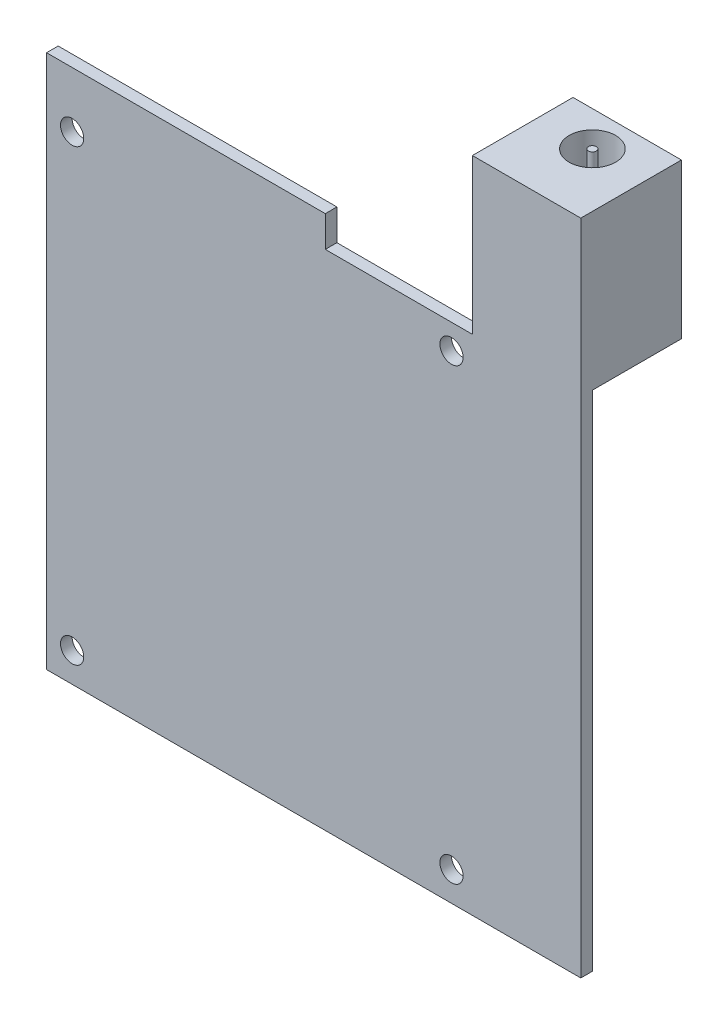
ISO-10303-21;
HEADER;
FILE_DESCRIPTION(('STEP AP214'),'2;1');
FILE_NAME('part.step','',(''),(''),'','','');
FILE_SCHEMA(('AUTOMOTIVE_DESIGN { 1 0 10303 214 1 1 1 1 }'));
ENDSEC;
DATA;
#1=APPLICATION_CONTEXT('core data for automotive mechanical design processes');
#2=APPLICATION_PROTOCOL_DEFINITION('international standard','automotive_design',2000,#1);
#3=PRODUCT_CONTEXT('',#1,'mechanical');
#4=PRODUCT('Part','Part','',(#3));
#5=PRODUCT_RELATED_PRODUCT_CATEGORY('part','',(#4));
#6=PRODUCT_DEFINITION_FORMATION('','',#4);
#7=PRODUCT_DEFINITION_CONTEXT('part definition',#1,'design');
#8=PRODUCT_DEFINITION('design','',#6,#7);
#9=PRODUCT_DEFINITION_SHAPE('','',#8);
#10=(LENGTH_UNIT() NAMED_UNIT(*) SI_UNIT(.MILLI.,.METRE.));
#11=(NAMED_UNIT(*) PLANE_ANGLE_UNIT() SI_UNIT($,.RADIAN.));
#12=(NAMED_UNIT(*) SI_UNIT($,.STERADIAN.) SOLID_ANGLE_UNIT());
#13=UNCERTAINTY_MEASURE_WITH_UNIT(LENGTH_MEASURE(1.E-05),#10,'distance_accuracy_value','');
#14=(GEOMETRIC_REPRESENTATION_CONTEXT(3) GLOBAL_UNCERTAINTY_ASSIGNED_CONTEXT((#13)) GLOBAL_UNIT_ASSIGNED_CONTEXT((#10,
#11,#12)) REPRESENTATION_CONTEXT('',''));
#15=CARTESIAN_POINT('',(0.,0.,0.));
#16=DIRECTION('',(0.,0.,1.));
#17=DIRECTION('',(1.,0.,0.));
#18=AXIS2_PLACEMENT_3D('',#15,#16,#17);
#19=CARTESIAN_POINT('',(0.,65.,1.5));
#20=DIRECTION('',(0.,1.,0.));
#21=DIRECTION('',(0.,0.,1.));
#22=AXIS2_PLACEMENT_3D('',#19,#20,#21);
#23=PLANE('',#22);
#24=DIRECTION('',(1.,0.,0.));
#25=VECTOR('',#24,1.);
#26=CARTESIAN_POINT('',(0.,65.,0.));
#27=LINE('',#26,#25);
#28=CARTESIAN_POINT('',(36.,65.,0.));
#29=VERTEX_POINT('',#28);
#30=CARTESIAN_POINT('',(55.,65.,0.));
#31=VERTEX_POINT('',#30);
#32=EDGE_CURVE('E153',#29,#31,#27,.T.);
#33=ORIENTED_EDGE('',*,*,#32,.F.);
#34=DIRECTION('',(0.,0.,-1.));
#35=VECTOR('',#34,1.);
#36=CARTESIAN_POINT('',(36.,65.,1.5));
#37=LINE('',#36,#35);
#38=CARTESIAN_POINT('',(36.,65.,1.5));
#39=VERTEX_POINT('',#38);
#40=EDGE_CURVE('E11',#39,#29,#37,.T.);
#41=ORIENTED_EDGE('',*,*,#40,.F.);
#42=DIRECTION('',(1.,0.,0.));
#43=VECTOR('',#42,1.);
#44=CARTESIAN_POINT('',(0.,65.,1.5));
#45=LINE('',#44,#43);
#46=CARTESIAN_POINT('',(55.,65.,1.5));
#47=VERTEX_POINT('',#46);
#48=EDGE_CURVE('E193',#39,#47,#45,.T.);
#49=ORIENTED_EDGE('',*,*,#48,.T.);
#50=DIRECTION('',(0.,0.,-1.));
#51=VECTOR('',#50,1.);
#52=CARTESIAN_POINT('',(55.,65.,1.5));
#53=LINE('',#52,#51);
#54=EDGE_CURVE('E146',#47,#31,#53,.T.);
#55=ORIENTED_EDGE('',*,*,#54,.T.);
#56=EDGE_LOOP('',(#33,#41,#49,#55));
#57=FACE_BOUND('',#56,.T.);
#58=ADVANCED_FACE('F36',(#57),#23,.T.);
#59=CARTESIAN_POINT('',(36.,0.,1.5));
#60=DIRECTION('',(1.,0.,0.));
#61=DIRECTION('',(0.,1.,0.));
#62=AXIS2_PLACEMENT_3D('',#59,#60,#61);
#63=PLANE('',#62);
#64=DIRECTION('',(0.,-1.,0.));
#65=VECTOR('',#64,1.);
#66=CARTESIAN_POINT('',(36.,0.,0.));
#67=LINE('',#66,#65);
#68=CARTESIAN_POINT('',(36.,69.,0.));
#69=VERTEX_POINT('',#68);
#70=EDGE_CURVE('E156',#69,#29,#67,.T.);
#71=ORIENTED_EDGE('',*,*,#70,.F.);
#72=DIRECTION('',(0.,0.,-1.));
#73=VECTOR('',#72,1.);
#74=CARTESIAN_POINT('',(36.,69.,1.5));
#75=LINE('',#74,#73);
#76=CARTESIAN_POINT('',(36.,69.,1.5));
#77=VERTEX_POINT('',#76);
#78=EDGE_CURVE('E45',#77,#69,#75,.T.);
#79=ORIENTED_EDGE('',*,*,#78,.F.);
#80=DIRECTION('',(0.,-1.,0.));
#81=VECTOR('',#80,1.);
#82=CARTESIAN_POINT('',(36.,0.,1.5));
#83=LINE('',#82,#81);
#84=EDGE_CURVE('E195',#77,#39,#83,.T.);
#85=ORIENTED_EDGE('',*,*,#84,.T.);
#86=ORIENTED_EDGE('',*,*,#40,.T.);
#87=EDGE_LOOP('',(#71,#79,#85,#86));
#88=FACE_BOUND('',#87,.T.);
#89=ADVANCED_FACE('F246',(#88),#63,.T.);
#90=CARTESIAN_POINT('',(0.,69.,1.5));
#91=DIRECTION('',(0.,1.,0.));
#92=DIRECTION('',(0.,0.,1.));
#93=AXIS2_PLACEMENT_3D('',#90,#91,#92);
#94=PLANE('',#93);
#95=DIRECTION('',(1.,0.,0.));
#96=VECTOR('',#95,1.);
#97=CARTESIAN_POINT('',(0.,69.,0.));
#98=LINE('',#97,#96);
#99=CARTESIAN_POINT('',(0.,69.,0.));
#100=VERTEX_POINT('',#99);
#101=EDGE_CURVE('E159',#100,#69,#98,.T.);
#102=ORIENTED_EDGE('',*,*,#101,.F.);
#103=DIRECTION('',(0.,0.,-1.));
#104=VECTOR('',#103,1.);
#105=CARTESIAN_POINT('',(0.,69.,1.5));
#106=LINE('',#105,#104);
#107=CARTESIAN_POINT('',(0.,69.,1.5));
#108=VERTEX_POINT('',#107);
#109=EDGE_CURVE('E206',#108,#100,#106,.T.);
#110=ORIENTED_EDGE('',*,*,#109,.F.);
#111=DIRECTION('',(1.,0.,0.));
#112=VECTOR('',#111,1.);
#113=CARTESIAN_POINT('',(0.,69.,1.5));
#114=LINE('',#113,#112);
#115=EDGE_CURVE('E198',#108,#77,#114,.T.);
#116=ORIENTED_EDGE('',*,*,#115,.T.);
#117=ORIENTED_EDGE('',*,*,#78,.T.);
#118=EDGE_LOOP('',(#102,#110,#116,#117));
#119=FACE_BOUND('',#118,.T.);
#120=ADVANCED_FACE('F212',(#119),#94,.T.);
#121=CARTESIAN_POINT('',(0.,0.,1.5));
#122=DIRECTION('',(-1.,0.,0.));
#123=DIRECTION('',(0.,-1.,0.));
#124=AXIS2_PLACEMENT_3D('',#121,#122,#123);
#125=PLANE('',#124);
#126=DIRECTION('',(0.,1.,0.));
#127=VECTOR('',#126,1.);
#128=CARTESIAN_POINT('',(0.,0.,0.));
#129=LINE('',#128,#127);
#130=CARTESIAN_POINT('',(0.,0.,0.));
#131=VERTEX_POINT('',#130);
#132=EDGE_CURVE('E162',#131,#100,#129,.T.);
#133=ORIENTED_EDGE('',*,*,#132,.F.);
#134=DIRECTION('',(0.,0.,-1.));
#135=VECTOR('',#134,1.);
#136=CARTESIAN_POINT('',(0.,0.,1.5));
#137=LINE('',#136,#135);
#138=CARTESIAN_POINT('',(0.,0.,1.5));
#139=VERTEX_POINT('',#138);
#140=EDGE_CURVE('E208',#139,#131,#137,.T.);
#141=ORIENTED_EDGE('',*,*,#140,.F.);
#142=DIRECTION('',(0.,1.,0.));
#143=VECTOR('',#142,1.);
#144=CARTESIAN_POINT('',(0.,0.,1.5));
#145=LINE('',#144,#143);
#146=EDGE_CURVE('E201',#139,#108,#145,.T.);
#147=ORIENTED_EDGE('',*,*,#146,.T.);
#148=ORIENTED_EDGE('',*,*,#109,.T.);
#149=EDGE_LOOP('',(#133,#141,#147,#148));
#150=FACE_BOUND('',#149,.T.);
#151=ADVANCED_FACE('F205',(#150),#125,.T.);
#152=CARTESIAN_POINT('',(0.,0.,1.5));
#153=DIRECTION('',(0.,1.,0.));
#154=DIRECTION('',(0.,0.,1.));
#155=AXIS2_PLACEMENT_3D('',#152,#153,#154);
#156=PLANE('',#155);
#157=DIRECTION('',(1.,0.,0.));
#158=VECTOR('',#157,1.);
#159=CARTESIAN_POINT('',(0.,0.,0.));
#160=LINE('',#159,#158);
#161=CARTESIAN_POINT('',(69.,0.,0.));
#162=VERTEX_POINT('',#161);
#163=EDGE_CURVE('E165',#131,#162,#160,.T.);
#164=ORIENTED_EDGE('',*,*,#163,.T.);
#165=DIRECTION('',(0.,0.,-1.));
#166=VECTOR('',#165,1.);
#167=CARTESIAN_POINT('',(69.,0.,1.5));
#168=LINE('',#167,#166);
#169=CARTESIAN_POINT('',(69.,0.,1.5));
#170=VERTEX_POINT('',#169);
#171=EDGE_CURVE('E131',#170,#162,#168,.T.);
#172=ORIENTED_EDGE('',*,*,#171,.F.);
#173=DIRECTION('',(1.,0.,0.));
#174=VECTOR('',#173,1.);
#175=CARTESIAN_POINT('',(0.,0.,1.5));
#176=LINE('',#175,#174);
#177=EDGE_CURVE('E118',#139,#170,#176,.T.);
#178=ORIENTED_EDGE('',*,*,#177,.F.);
#179=ORIENTED_EDGE('',*,*,#140,.T.);
#180=EDGE_LOOP('',(#164,#172,#178,#179));
#181=FACE_BOUND('',#180,.T.);
#182=ADVANCED_FACE('F326',(#181),#156,.F.);
#183=CARTESIAN_POINT('',(69.,0.,1.5));
#184=DIRECTION('',(-1.,0.,0.));
#185=DIRECTION('',(0.,0.,1.));
#186=AXIS2_PLACEMENT_3D('',#183,#184,#185);
#187=PLANE('',#186);
#188=DIRECTION('',(0.,1.,0.));
#189=VECTOR('',#188,1.);
#190=CARTESIAN_POINT('',(69.,0.,0.));
#191=LINE('',#190,#189);
#192=CARTESIAN_POINT('',(69.,65.,0.));
#193=VERTEX_POINT('',#192);
#194=EDGE_CURVE('E86',#162,#193,#191,.T.);
#195=ORIENTED_EDGE('',*,*,#194,.T.);
#196=DIRECTION('',(0.,0.,1.));
#197=VECTOR('',#196,1.);
#198=CARTESIAN_POINT('',(69.,65.,-11.5));
#199=LINE('',#198,#197);
#200=CARTESIAN_POINT('',(69.,65.,-11.5));
#201=VERTEX_POINT('',#200);
#202=EDGE_CURVE('E53',#201,#193,#199,.T.);
#203=ORIENTED_EDGE('',*,*,#202,.F.);
#204=DIRECTION('',(0.,1.,0.));
#205=VECTOR('',#204,1.);
#206=CARTESIAN_POINT('',(69.,0.,-11.5));
#207=LINE('',#206,#205);
#208=CARTESIAN_POINT('',(69.,85.,-11.5));
#209=VERTEX_POINT('',#208);
#210=EDGE_CURVE('E127',#201,#209,#207,.T.);
#211=ORIENTED_EDGE('',*,*,#210,.T.);
#212=DIRECTION('',(0.,0.,-1.));
#213=VECTOR('',#212,1.);
#214=CARTESIAN_POINT('',(69.,85.,1.5));
#215=LINE('',#214,#213);
#216=CARTESIAN_POINT('',(69.,85.,1.5));
#217=VERTEX_POINT('',#216);
#218=EDGE_CURVE('E124',#217,#209,#215,.T.);
#219=ORIENTED_EDGE('',*,*,#218,.F.);
#220=DIRECTION('',(0.,1.,0.));
#221=VECTOR('',#220,1.);
#222=CARTESIAN_POINT('',(69.,0.,1.5));
#223=LINE('',#222,#221);
#224=EDGE_CURVE('E110',#170,#217,#223,.T.);
#225=ORIENTED_EDGE('',*,*,#224,.F.);
#226=ORIENTED_EDGE('',*,*,#171,.T.);
#227=EDGE_LOOP('',(#195,#203,#211,#219,#225,#226));
#228=FACE_BOUND('',#227,.T.);
#229=ADVANCED_FACE('F125',(#228),#187,.F.);
#230=CARTESIAN_POINT('',(0.,85.,1.5));
#231=DIRECTION('',(0.,1.,0.));
#232=DIRECTION('',(0.,0.,1.));
#233=AXIS2_PLACEMENT_3D('',#230,#231,#232);
#234=PLANE('',#233);
#235=CARTESIAN_POINT('',(62.,85.,-7.));
#236=DIRECTION('',(0.,1.,0.));
#237=DIRECTION('',(0.,0.,1.));
#238=AXIS2_PLACEMENT_3D('',#235,#236,#237);
#239=CIRCLE('',#238,3.00000000000001);
#240=CARTESIAN_POINT('',(62.,85.,-3.99999999999999));
#241=VERTEX_POINT('',#240);
#242=EDGE_CURVE('E464',#241,#241,#239,.T.);
#243=ORIENTED_EDGE('',*,*,#242,.F.);
#244=EDGE_LOOP('',(#243));
#245=FACE_BOUND('',#244,.T.);
#246=ORIENTED_EDGE('',*,*,#218,.T.);
#247=DIRECTION('',(1.,0.,0.));
#248=VECTOR('',#247,1.);
#249=CARTESIAN_POINT('',(0.,85.,-11.5));
#250=LINE('',#249,#248);
#251=CARTESIAN_POINT('',(55.,85.,-11.5));
#252=VERTEX_POINT('',#251);
#253=EDGE_CURVE('E177',#252,#209,#250,.T.);
#254=ORIENTED_EDGE('',*,*,#253,.F.);
#255=DIRECTION('',(0.,0.,-1.));
#256=VECTOR('',#255,1.);
#257=CARTESIAN_POINT('',(55.,85.,1.5));
#258=LINE('',#257,#256);
#259=CARTESIAN_POINT('',(55.,85.,1.5));
#260=VERTEX_POINT('',#259);
#261=EDGE_CURVE('E132',#260,#252,#258,.T.);
#262=ORIENTED_EDGE('',*,*,#261,.F.);
#263=DIRECTION('',(1.,0.,0.));
#264=VECTOR('',#263,1.);
#265=CARTESIAN_POINT('',(0.,85.,1.5));
#266=LINE('',#265,#264);
#267=EDGE_CURVE('E115',#260,#217,#266,.T.);
#268=ORIENTED_EDGE('',*,*,#267,.T.);
#269=EDGE_LOOP('',(#246,#254,#262,#268));
#270=FACE_BOUND('',#269,.T.);
#271=ADVANCED_FACE('F134',(#245,#270),#234,.T.);
#272=CARTESIAN_POINT('',(52.3,61.8,1.5));
#273=DIRECTION('',(0.,0.,-1.));
#274=DIRECTION('',(-1.,0.,0.));
#275=AXIS2_PLACEMENT_3D('',#272,#273,#274);
#276=CYLINDRICAL_SURFACE('',#275,1.50000000000001);
#277=CARTESIAN_POINT('',(52.3,61.8,1.5));
#278=DIRECTION('',(0.,0.,1.));
#279=DIRECTION('',(1.,0.,0.));
#280=AXIS2_PLACEMENT_3D('',#277,#278,#279);
#281=CIRCLE('',#280,1.50000000000001);
#282=CARTESIAN_POINT('',(53.8,61.8,1.5));
#283=VERTEX_POINT('',#282);
#284=EDGE_CURVE('E137',#283,#283,#281,.T.);
#285=ORIENTED_EDGE('',*,*,#284,.T.);
#286=EDGE_LOOP('',(#285));
#287=FACE_BOUND('',#286,.T.);
#288=CARTESIAN_POINT('',(52.3,61.8,0.));
#289=DIRECTION('',(0.,0.,1.));
#290=DIRECTION('',(1.,0.,0.));
#291=AXIS2_PLACEMENT_3D('',#288,#289,#290);
#292=CIRCLE('',#291,1.50000000000001);
#293=CARTESIAN_POINT('',(53.8,61.8,0.));
#294=VERTEX_POINT('',#293);
#295=EDGE_CURVE('E170',#294,#294,#292,.T.);
#296=ORIENTED_EDGE('',*,*,#295,.F.);
#297=EDGE_LOOP('',(#296));
#298=FACE_BOUND('',#297,.T.);
#299=ADVANCED_FACE('F229',(#287,#298),#276,.F.);
#300=CARTESIAN_POINT('',(55.,0.,1.5));
#301=DIRECTION('',(1.,0.,0.));
#302=DIRECTION('',(0.,0.,-1.));
#303=AXIS2_PLACEMENT_3D('',#300,#301,#302);
#304=PLANE('',#303);
#305=ORIENTED_EDGE('',*,*,#261,.T.);
#306=DIRECTION('',(0.,-1.,0.));
#307=VECTOR('',#306,1.);
#308=CARTESIAN_POINT('',(55.,0.,-11.5));
#309=LINE('',#308,#307);
#310=CARTESIAN_POINT('',(55.,65.,-11.5));
#311=VERTEX_POINT('',#310);
#312=EDGE_CURVE('E274',#252,#311,#309,.T.);
#313=ORIENTED_EDGE('',*,*,#312,.T.);
#314=DIRECTION('',(0.,0.,1.));
#315=VECTOR('',#314,1.);
#316=CARTESIAN_POINT('',(55.,65.,-11.5));
#317=LINE('',#316,#315);
#318=EDGE_CURVE('E183',#311,#31,#317,.T.);
#319=ORIENTED_EDGE('',*,*,#318,.T.);
#320=ORIENTED_EDGE('',*,*,#54,.F.);
#321=DIRECTION('',(0.,-1.,0.));
#322=VECTOR('',#321,1.);
#323=CARTESIAN_POINT('',(55.,0.,1.5));
#324=LINE('',#323,#322);
#325=EDGE_CURVE('E62',#260,#47,#324,.T.);
#326=ORIENTED_EDGE('',*,*,#325,.F.);
#327=EDGE_LOOP('',(#305,#313,#319,#320,#326));
#328=FACE_BOUND('',#327,.T.);
#329=ADVANCED_FACE('F231',(#328),#304,.F.);
#330=CARTESIAN_POINT('',(3.3,3.8,1.5));
#331=DIRECTION('',(0.,0.,-1.));
#332=DIRECTION('',(-1.,0.,0.));
#333=AXIS2_PLACEMENT_3D('',#330,#331,#332);
#334=CYLINDRICAL_SURFACE('',#333,1.5);
#335=CARTESIAN_POINT('',(3.3,3.8,1.5));
#336=DIRECTION('',(0.,0.,1.));
#337=DIRECTION('',(1.,0.,0.));
#338=AXIS2_PLACEMENT_3D('',#335,#336,#337);
#339=CIRCLE('',#338,1.5);
#340=CARTESIAN_POINT('',(4.8,3.8,1.5));
#341=VERTEX_POINT('',#340);
#342=EDGE_CURVE('E189',#341,#341,#339,.T.);
#343=ORIENTED_EDGE('',*,*,#342,.T.);
#344=EDGE_LOOP('',(#343));
#345=FACE_BOUND('',#344,.T.);
#346=CARTESIAN_POINT('',(3.3,3.8,0.));
#347=DIRECTION('',(0.,0.,1.));
#348=DIRECTION('',(1.,0.,0.));
#349=AXIS2_PLACEMENT_3D('',#346,#347,#348);
#350=CIRCLE('',#349,1.5);
#351=CARTESIAN_POINT('',(4.8,3.8,0.));
#352=VERTEX_POINT('',#351);
#353=EDGE_CURVE('E150',#352,#352,#350,.T.);
#354=ORIENTED_EDGE('',*,*,#353,.F.);
#355=EDGE_LOOP('',(#354));
#356=FACE_BOUND('',#355,.T.);
#357=ADVANCED_FACE('F238',(#345,#356),#334,.F.);
#358=CARTESIAN_POINT('',(52.3,3.8,1.5));
#359=DIRECTION('',(0.,0.,-1.));
#360=DIRECTION('',(-1.,0.,0.));
#361=AXIS2_PLACEMENT_3D('',#358,#359,#360);
#362=CYLINDRICAL_SURFACE('',#361,1.5);
#363=CARTESIAN_POINT('',(52.3,3.8,1.5));
#364=DIRECTION('',(0.,0.,1.));
#365=DIRECTION('',(1.,0.,0.));
#366=AXIS2_PLACEMENT_3D('',#363,#364,#365);
#367=CIRCLE('',#366,1.5);
#368=CARTESIAN_POINT('',(53.8,3.8,1.5));
#369=VERTEX_POINT('',#368);
#370=EDGE_CURVE('E186',#369,#369,#367,.F.);
#371=ORIENTED_EDGE('',*,*,#370,.F.);
#372=EDGE_LOOP('',(#371));
#373=FACE_BOUND('',#372,.T.);
#374=CARTESIAN_POINT('',(52.3,3.8,0.));
#375=DIRECTION('',(0.,0.,1.));
#376=DIRECTION('',(1.,0.,0.));
#377=AXIS2_PLACEMENT_3D('',#374,#375,#376);
#378=CIRCLE('',#377,1.5);
#379=CARTESIAN_POINT('',(53.8,3.8,0.));
#380=VERTEX_POINT('',#379);
#381=EDGE_CURVE('E147',#380,#380,#378,.F.);
#382=ORIENTED_EDGE('',*,*,#381,.T.);
#383=EDGE_LOOP('',(#382));
#384=FACE_BOUND('',#383,.T.);
#385=ADVANCED_FACE('F38',(#373,#384),#362,.F.);
#386=CARTESIAN_POINT('',(3.3,61.8,1.5));
#387=DIRECTION('',(0.,0.,-1.));
#388=DIRECTION('',(-1.,0.,0.));
#389=AXIS2_PLACEMENT_3D('',#386,#387,#388);
#390=CYLINDRICAL_SURFACE('',#389,1.5);
#391=CARTESIAN_POINT('',(3.3,61.8,1.5));
#392=DIRECTION('',(0.,0.,1.));
#393=DIRECTION('',(1.,0.,0.));
#394=AXIS2_PLACEMENT_3D('',#391,#392,#393);
#395=CIRCLE('',#394,1.5);
#396=CARTESIAN_POINT('',(4.80000000000001,61.8,1.5));
#397=VERTEX_POINT('',#396);
#398=EDGE_CURVE('E143',#397,#397,#395,.F.);
#399=ORIENTED_EDGE('',*,*,#398,.F.);
#400=EDGE_LOOP('',(#399));
#401=FACE_BOUND('',#400,.T.);
#402=CARTESIAN_POINT('',(3.3,61.8,0.));
#403=DIRECTION('',(0.,0.,1.));
#404=DIRECTION('',(1.,0.,0.));
#405=AXIS2_PLACEMENT_3D('',#402,#403,#404);
#406=CIRCLE('',#405,1.5);
#407=CARTESIAN_POINT('',(4.80000000000001,61.8,0.));
#408=VERTEX_POINT('',#407);
#409=EDGE_CURVE('E190',#408,#408,#406,.F.);
#410=ORIENTED_EDGE('',*,*,#409,.T.);
#411=EDGE_LOOP('',(#410));
#412=FACE_BOUND('',#411,.T.);
#413=ADVANCED_FACE('F259',(#401,#412),#390,.F.);
#414=CARTESIAN_POINT('',(0.,0.,1.5));
#415=DIRECTION('',(0.,0.,1.));
#416=DIRECTION('',(1.,0.,0.));
#417=AXIS2_PLACEMENT_3D('',#414,#415,#416);
#418=PLANE('',#417);
#419=ORIENTED_EDGE('',*,*,#370,.T.);
#420=EDGE_LOOP('',(#419));
#421=FACE_BOUND('',#420,.T.);
#422=ORIENTED_EDGE('',*,*,#342,.F.);
#423=EDGE_LOOP('',(#422));
#424=FACE_BOUND('',#423,.T.);
#425=ORIENTED_EDGE('',*,*,#48,.F.);
#426=ORIENTED_EDGE('',*,*,#84,.F.);
#427=ORIENTED_EDGE('',*,*,#115,.F.);
#428=ORIENTED_EDGE('',*,*,#146,.F.);
#429=ORIENTED_EDGE('',*,*,#177,.T.);
#430=ORIENTED_EDGE('',*,*,#224,.T.);
#431=ORIENTED_EDGE('',*,*,#267,.F.);
#432=ORIENTED_EDGE('',*,*,#325,.T.);
#433=EDGE_LOOP('',(#425,#426,#427,#428,#429,#430,#431,#432));
#434=FACE_BOUND('',#433,.T.);
#435=ORIENTED_EDGE('',*,*,#284,.F.);
#436=EDGE_LOOP('',(#435));
#437=FACE_BOUND('',#436,.T.);
#438=ORIENTED_EDGE('',*,*,#398,.T.);
#439=EDGE_LOOP('',(#438));
#440=FACE_BOUND('',#439,.T.);
#441=ADVANCED_FACE('F112',(#421,#424,#434,#437,#440),#418,.T.);
#442=CARTESIAN_POINT('',(0.,0.,0.));
#443=DIRECTION('',(0.,0.,1.));
#444=DIRECTION('',(1.,0.,0.));
#445=AXIS2_PLACEMENT_3D('',#442,#443,#444);
#446=PLANE('',#445);
#447=ORIENTED_EDGE('',*,*,#381,.F.);
#448=EDGE_LOOP('',(#447));
#449=FACE_BOUND('',#448,.T.);
#450=ORIENTED_EDGE('',*,*,#353,.T.);
#451=EDGE_LOOP('',(#450));
#452=FACE_BOUND('',#451,.T.);
#453=ORIENTED_EDGE('',*,*,#32,.T.);
#454=DIRECTION('',(1.,0.,0.));
#455=VECTOR('',#454,1.);
#456=CARTESIAN_POINT('',(0.,65.,0.));
#457=LINE('',#456,#455);
#458=EDGE_CURVE('E175',#31,#193,#457,.T.);
#459=ORIENTED_EDGE('',*,*,#458,.T.);
#460=ORIENTED_EDGE('',*,*,#194,.F.);
#461=ORIENTED_EDGE('',*,*,#163,.F.);
#462=ORIENTED_EDGE('',*,*,#132,.T.);
#463=ORIENTED_EDGE('',*,*,#101,.T.);
#464=ORIENTED_EDGE('',*,*,#70,.T.);
#465=EDGE_LOOP('',(#453,#459,#460,#461,#462,#463,#464));
#466=FACE_BOUND('',#465,.T.);
#467=ORIENTED_EDGE('',*,*,#295,.T.);
#468=EDGE_LOOP('',(#467));
#469=FACE_BOUND('',#468,.T.);
#470=ORIENTED_EDGE('',*,*,#409,.F.);
#471=EDGE_LOOP('',(#470));
#472=FACE_BOUND('',#471,.T.);
#473=ADVANCED_FACE('F226',(#449,#452,#466,#469,#472),#446,.F.);
#474=CARTESIAN_POINT('',(0.,65.,-11.5));
#475=DIRECTION('',(0.,-1.,0.));
#476=DIRECTION('',(0.,0.,-1.));
#477=AXIS2_PLACEMENT_3D('',#474,#475,#476);
#478=PLANE('',#477);
#479=ORIENTED_EDGE('',*,*,#458,.F.);
#480=ORIENTED_EDGE('',*,*,#318,.F.);
#481=DIRECTION('',(1.,0.,0.));
#482=VECTOR('',#481,1.);
#483=CARTESIAN_POINT('',(0.,65.,-11.5));
#484=LINE('',#483,#482);
#485=EDGE_CURVE('E472',#311,#201,#484,.T.);
#486=ORIENTED_EDGE('',*,*,#485,.T.);
#487=ORIENTED_EDGE('',*,*,#202,.T.);
#488=EDGE_LOOP('',(#479,#480,#486,#487));
#489=FACE_BOUND('',#488,.T.);
#490=ADVANCED_FACE('F266',(#489),#478,.T.);
#491=CARTESIAN_POINT('',(0.,0.,-11.5));
#492=DIRECTION('',(0.,0.,1.));
#493=DIRECTION('',(1.,0.,0.));
#494=AXIS2_PLACEMENT_3D('',#491,#492,#493);
#495=PLANE('',#494);
#496=ORIENTED_EDGE('',*,*,#253,.T.);
#497=ORIENTED_EDGE('',*,*,#210,.F.);
#498=ORIENTED_EDGE('',*,*,#485,.F.);
#499=ORIENTED_EDGE('',*,*,#312,.F.);
#500=EDGE_LOOP('',(#496,#497,#498,#499));
#501=FACE_BOUND('',#500,.T.);
#502=ADVANCED_FACE('F277',(#501),#495,.F.);
#503=CARTESIAN_POINT('',(62.,75.,-7.));
#504=DIRECTION('',(0.,1.,0.));
#505=DIRECTION('',(0.,0.,1.));
#506=AXIS2_PLACEMENT_3D('',#503,#504,#505);
#507=CYLINDRICAL_SURFACE('',#506,3.00000000000001);
#508=CARTESIAN_POINT('',(62.,75.,-7.));
#509=DIRECTION('',(0.,1.,0.));
#510=DIRECTION('',(0.,0.,1.));
#511=AXIS2_PLACEMENT_3D('',#508,#509,#510);
#512=CIRCLE('',#511,3.00000000000001);
#513=CARTESIAN_POINT('',(62.,75.,-3.99999999999999));
#514=VERTEX_POINT('',#513);
#515=EDGE_CURVE('E178',#514,#514,#512,.T.);
#516=ORIENTED_EDGE('',*,*,#515,.F.);
#517=EDGE_LOOP('',(#516));
#518=FACE_BOUND('',#517,.T.);
#519=ORIENTED_EDGE('',*,*,#242,.T.);
#520=EDGE_LOOP('',(#519));
#521=FACE_BOUND('',#520,.T.);
#522=ADVANCED_FACE('F282',(#518,#521),#507,.F.);
#523=CARTESIAN_POINT('',(62.,75.,-7.));
#524=DIRECTION('',(0.,1.,0.));
#525=DIRECTION('',(0.,0.,1.));
#526=AXIS2_PLACEMENT_3D('',#523,#524,#525);
#527=PLANE('',#526);
#528=CARTESIAN_POINT('',(62.,75.,-7.));
#529=DIRECTION('',(0.,1.,0.));
#530=DIRECTION('',(0.,0.,1.));
#531=AXIS2_PLACEMENT_3D('',#528,#529,#530);
#532=CIRCLE('',#531,0.499999999999992);
#533=CARTESIAN_POINT('',(62.,75.,-6.50000000000001));
#534=VERTEX_POINT('',#533);
#535=EDGE_CURVE('E461',#534,#534,#532,.T.);
#536=ORIENTED_EDGE('',*,*,#535,.F.);
#537=EDGE_LOOP('',(#536));
#538=FACE_BOUND('',#537,.T.);
#539=ORIENTED_EDGE('',*,*,#515,.T.);
#540=EDGE_LOOP('',(#539));
#541=FACE_BOUND('',#540,.T.);
#542=ADVANCED_FACE('F417',(#538,#541),#527,.T.);
#543=CARTESIAN_POINT('',(62.,75.,-7.));
#544=DIRECTION('',(0.,1.,0.));
#545=DIRECTION('',(0.,0.,1.));
#546=AXIS2_PLACEMENT_3D('',#543,#544,#545);
#547=CYLINDRICAL_SURFACE('',#546,0.499999999999992);
#548=ORIENTED_EDGE('',*,*,#535,.T.);
#549=EDGE_LOOP('',(#548));
#550=FACE_BOUND('',#549,.T.);
#551=CARTESIAN_POINT('',(62.,85.,-7.));
#552=DIRECTION('',(0.,1.,0.));
#553=DIRECTION('',(0.,0.,1.));
#554=AXIS2_PLACEMENT_3D('',#551,#552,#553);
#555=CIRCLE('',#554,0.499999999999992);
#556=CARTESIAN_POINT('',(62.,85.,-6.50000000000001));
#557=VERTEX_POINT('',#556);
#558=EDGE_CURVE('E459',#557,#557,#555,.T.);
#559=ORIENTED_EDGE('',*,*,#558,.F.);
#560=EDGE_LOOP('',(#559));
#561=FACE_BOUND('',#560,.T.);
#562=ADVANCED_FACE('F424',(#550,#561),#547,.T.);
#563=ORIENTED_EDGE('',*,*,#558,.T.);
#564=EDGE_LOOP('',(#563));
#565=FACE_BOUND('',#564,.T.);
#566=ADVANCED_FACE('F243',(#565),#234,.T.);
#567=CLOSED_SHELL('',(#58,#89,#120,#151,#182,#229,#271,#299,#329,#357,#385,#413,#441,#473,#490,
#502,#522,#542,#562,#566));
#568=MANIFOLD_SOLID_BREP('B2',#567);
#569=ADVANCED_BREP_SHAPE_REPRESENTATION('',(#18,#568),#14);
#570=SHAPE_DEFINITION_REPRESENTATION(#9,#569);
ENDSEC;
END-ISO-10303-21;
